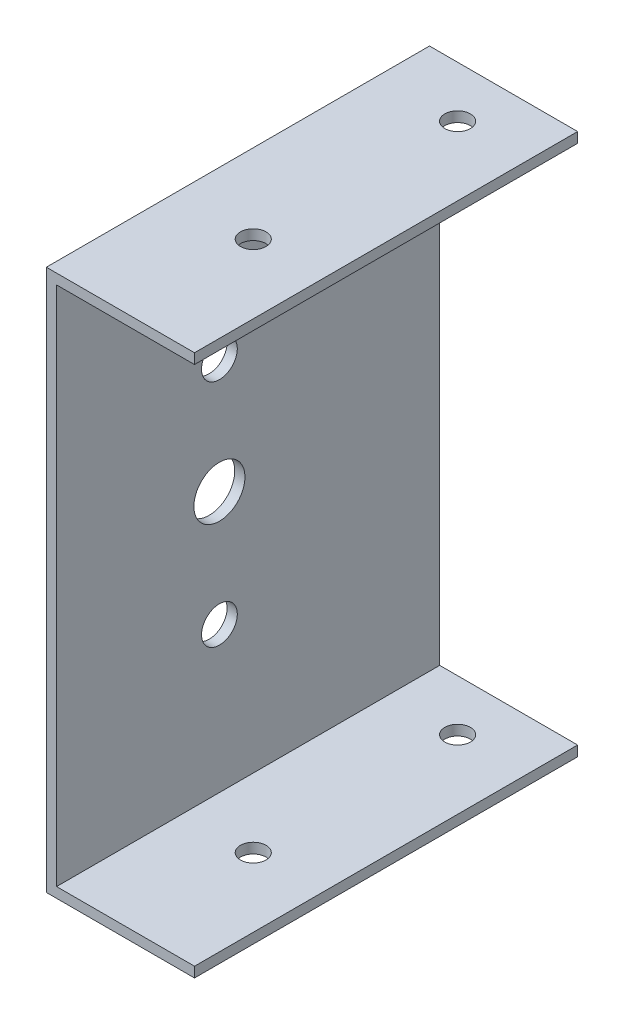
ISO-10303-21;
HEADER;
FILE_DESCRIPTION(('STEP AP214'),'2;1');
FILE_NAME('part.step','',(''),(''),'','','');
FILE_SCHEMA(('AUTOMOTIVE_DESIGN { 1 0 10303 214 1 1 1 1 }'));
ENDSEC;
DATA;
#1=APPLICATION_CONTEXT('core data for automotive mechanical design processes');
#2=APPLICATION_PROTOCOL_DEFINITION('international standard','automotive_design',2000,#1);
#3=PRODUCT_CONTEXT('',#1,'mechanical');
#4=PRODUCT('Part','Part','',(#3));
#5=PRODUCT_RELATED_PRODUCT_CATEGORY('part','',(#4));
#6=PRODUCT_DEFINITION_FORMATION('','',#4);
#7=PRODUCT_DEFINITION_CONTEXT('part definition',#1,'design');
#8=PRODUCT_DEFINITION('design','',#6,#7);
#9=PRODUCT_DEFINITION_SHAPE('','',#8);
#10=(LENGTH_UNIT() NAMED_UNIT(*) SI_UNIT(.MILLI.,.METRE.));
#11=(NAMED_UNIT(*) PLANE_ANGLE_UNIT() SI_UNIT($,.RADIAN.));
#12=(NAMED_UNIT(*) SI_UNIT($,.STERADIAN.) SOLID_ANGLE_UNIT());
#13=UNCERTAINTY_MEASURE_WITH_UNIT(LENGTH_MEASURE(1.E-05),#10,'distance_accuracy_value','');
#14=(GEOMETRIC_REPRESENTATION_CONTEXT(3) GLOBAL_UNCERTAINTY_ASSIGNED_CONTEXT((#13)) GLOBAL_UNIT_ASSIGNED_CONTEXT((#10,
#11,#12)) REPRESENTATION_CONTEXT('',''));
#15=CARTESIAN_POINT('',(0.,0.,0.));
#16=DIRECTION('',(0.,0.,1.));
#17=DIRECTION('',(1.,0.,0.));
#18=AXIS2_PLACEMENT_3D('',#15,#16,#17);
#19=CARTESIAN_POINT('',(13.5,2.,37.5));
#20=DIRECTION('',(0.,0.,-1.));
#21=DIRECTION('',(-1.,0.,0.));
#22=AXIS2_PLACEMENT_3D('',#19,#20,#21);
#23=PLANE('',#22);
#24=DIRECTION('',(1.,0.,0.));
#25=VECTOR('',#24,1.);
#26=CARTESIAN_POINT('',(13.5,0.,37.5));
#27=LINE('',#26,#25);
#28=CARTESIAN_POINT('',(-15.5,0.,37.5));
#29=VERTEX_POINT('',#28);
#30=CARTESIAN_POINT('',(13.5,0.,37.5));
#31=VERTEX_POINT('',#30);
#32=EDGE_CURVE('E70',#29,#31,#27,.T.);
#33=ORIENTED_EDGE('',*,*,#32,.T.);
#34=DIRECTION('',(0.,-1.,0.));
#35=VECTOR('',#34,1.);
#36=CARTESIAN_POINT('',(13.5,2.,37.5));
#37=LINE('',#36,#35);
#38=CARTESIAN_POINT('',(13.5,2.,37.5));
#39=VERTEX_POINT('',#38);
#40=EDGE_CURVE('E11',#39,#31,#37,.T.);
#41=ORIENTED_EDGE('',*,*,#40,.F.);
#42=DIRECTION('',(1.,0.,0.));
#43=VECTOR('',#42,1.);
#44=CARTESIAN_POINT('',(13.5,2.,37.5));
#45=LINE('',#44,#43);
#46=CARTESIAN_POINT('',(-13.5,2.,37.5));
#47=VERTEX_POINT('',#46);
#48=EDGE_CURVE('E97',#47,#39,#45,.T.);
#49=ORIENTED_EDGE('',*,*,#48,.F.);
#50=DIRECTION('',(0.,1.,0.));
#51=VECTOR('',#50,1.);
#52=CARTESIAN_POINT('',(-13.5,0.,37.5));
#53=LINE('',#52,#51);
#54=CARTESIAN_POINT('',(-13.5,104.,37.5));
#55=VERTEX_POINT('',#54);
#56=EDGE_CURVE('E87',#47,#55,#53,.T.);
#57=ORIENTED_EDGE('',*,*,#56,.T.);
#58=DIRECTION('',(1.,0.,0.));
#59=VECTOR('',#58,1.);
#60=CARTESIAN_POINT('',(-15.5,104.,37.5));
#61=LINE('',#60,#59);
#62=CARTESIAN_POINT('',(13.5,104.,37.5));
#63=VERTEX_POINT('',#62);
#64=EDGE_CURVE('E189',#55,#63,#61,.T.);
#65=ORIENTED_EDGE('',*,*,#64,.T.);
#66=DIRECTION('',(0.,-1.,0.));
#67=VECTOR('',#66,1.);
#68=CARTESIAN_POINT('',(13.5,106.,37.5));
#69=LINE('',#68,#67);
#70=CARTESIAN_POINT('',(13.5,106.,37.5));
#71=VERTEX_POINT('',#70);
#72=EDGE_CURVE('E201',#71,#63,#69,.T.);
#73=ORIENTED_EDGE('',*,*,#72,.F.);
#74=DIRECTION('',(1.,0.,0.));
#75=VECTOR('',#74,1.);
#76=CARTESIAN_POINT('',(-15.5,106.,37.5));
#77=LINE('',#76,#75);
#78=CARTESIAN_POINT('',(-15.5,106.,37.5));
#79=VERTEX_POINT('',#78);
#80=EDGE_CURVE('E197',#79,#71,#77,.T.);
#81=ORIENTED_EDGE('',*,*,#80,.F.);
#82=DIRECTION('',(0.,1.,0.));
#83=VECTOR('',#82,1.);
#84=CARTESIAN_POINT('',(-15.5,0.,37.5));
#85=LINE('',#84,#83);
#86=EDGE_CURVE('E217',#29,#79,#85,.T.);
#87=ORIENTED_EDGE('',*,*,#86,.F.);
#88=EDGE_LOOP('',(#33,#41,#49,#57,#65,#73,#81,#87));
#89=FACE_BOUND('',#88,.T.);
#90=ADVANCED_FACE('F39',(#89),#23,.F.);
#91=CARTESIAN_POINT('',(13.5,2.,37.5));
#92=DIRECTION('',(-1.,0.,0.));
#93=DIRECTION('',(0.,0.,1.));
#94=AXIS2_PLACEMENT_3D('',#91,#92,#93);
#95=PLANE('',#94);
#96=DIRECTION('',(0.,0.,-1.));
#97=VECTOR('',#96,1.);
#98=CARTESIAN_POINT('',(13.5,0.,37.5));
#99=LINE('',#98,#97);
#100=CARTESIAN_POINT('',(13.5,0.,-37.5));
#101=VERTEX_POINT('',#100);
#102=EDGE_CURVE('E108',#31,#101,#99,.T.);
#103=ORIENTED_EDGE('',*,*,#102,.T.);
#104=DIRECTION('',(0.,-1.,0.));
#105=VECTOR('',#104,1.);
#106=CARTESIAN_POINT('',(13.5,2.,-37.5));
#107=LINE('',#106,#105);
#108=CARTESIAN_POINT('',(13.5,2.,-37.5));
#109=VERTEX_POINT('',#108);
#110=EDGE_CURVE('E49',#109,#101,#107,.T.);
#111=ORIENTED_EDGE('',*,*,#110,.F.);
#112=DIRECTION('',(0.,0.,-1.));
#113=VECTOR('',#112,1.);
#114=CARTESIAN_POINT('',(13.5,2.,37.5));
#115=LINE('',#114,#113);
#116=EDGE_CURVE('E58',#39,#109,#115,.T.);
#117=ORIENTED_EDGE('',*,*,#116,.F.);
#118=ORIENTED_EDGE('',*,*,#40,.T.);
#119=EDGE_LOOP('',(#103,#111,#117,#118));
#120=FACE_BOUND('',#119,.T.);
#121=ADVANCED_FACE('F254',(#120),#95,.F.);
#122=CARTESIAN_POINT('',(13.5,2.,-37.5));
#123=DIRECTION('',(0.,0.,1.));
#124=DIRECTION('',(1.,0.,0.));
#125=AXIS2_PLACEMENT_3D('',#122,#123,#124);
#126=PLANE('',#125);
#127=DIRECTION('',(-1.,0.,0.));
#128=VECTOR('',#127,1.);
#129=CARTESIAN_POINT('',(13.5,0.,-37.5));
#130=LINE('',#129,#128);
#131=CARTESIAN_POINT('',(-15.5,0.,-37.5));
#132=VERTEX_POINT('',#131);
#133=EDGE_CURVE('E104',#101,#132,#130,.T.);
#134=ORIENTED_EDGE('',*,*,#133,.T.);
#135=DIRECTION('',(0.,-1.,0.));
#136=VECTOR('',#135,1.);
#137=CARTESIAN_POINT('',(-15.5,0.,-37.5));
#138=LINE('',#137,#136);
#139=CARTESIAN_POINT('',(-15.5,106.,-37.5));
#140=VERTEX_POINT('',#139);
#141=EDGE_CURVE('E221',#140,#132,#138,.T.);
#142=ORIENTED_EDGE('',*,*,#141,.F.);
#143=DIRECTION('',(-1.,0.,0.));
#144=VECTOR('',#143,1.);
#145=CARTESIAN_POINT('',(13.5,106.,-37.5));
#146=LINE('',#145,#144);
#147=CARTESIAN_POINT('',(13.5,106.,-37.5));
#148=VERTEX_POINT('',#147);
#149=EDGE_CURVE('E188',#148,#140,#146,.T.);
#150=ORIENTED_EDGE('',*,*,#149,.F.);
#151=DIRECTION('',(0.,-1.,0.));
#152=VECTOR('',#151,1.);
#153=CARTESIAN_POINT('',(13.5,106.,-37.5));
#154=LINE('',#153,#152);
#155=CARTESIAN_POINT('',(13.5,104.,-37.5));
#156=VERTEX_POINT('',#155);
#157=EDGE_CURVE('E95',#148,#156,#154,.T.);
#158=ORIENTED_EDGE('',*,*,#157,.T.);
#159=DIRECTION('',(-1.,0.,0.));
#160=VECTOR('',#159,1.);
#161=CARTESIAN_POINT('',(13.5,104.,-37.5));
#162=LINE('',#161,#160);
#163=CARTESIAN_POINT('',(-13.5,104.,-37.5));
#164=VERTEX_POINT('',#163);
#165=EDGE_CURVE('E205',#156,#164,#162,.T.);
#166=ORIENTED_EDGE('',*,*,#165,.T.);
#167=DIRECTION('',(0.,-1.,0.));
#168=VECTOR('',#167,1.);
#169=CARTESIAN_POINT('',(-13.5,0.,-37.5));
#170=LINE('',#169,#168);
#171=CARTESIAN_POINT('',(-13.5,2.,-37.5));
#172=VERTEX_POINT('',#171);
#173=EDGE_CURVE('E111',#164,#172,#170,.T.);
#174=ORIENTED_EDGE('',*,*,#173,.T.);
#175=DIRECTION('',(-1.,0.,0.));
#176=VECTOR('',#175,1.);
#177=CARTESIAN_POINT('',(13.5,2.,-37.5));
#178=LINE('',#177,#176);
#179=EDGE_CURVE('E102',#109,#172,#178,.T.);
#180=ORIENTED_EDGE('',*,*,#179,.F.);
#181=ORIENTED_EDGE('',*,*,#110,.T.);
#182=EDGE_LOOP('',(#134,#142,#150,#158,#166,#174,#180,#181));
#183=FACE_BOUND('',#182,.T.);
#184=ADVANCED_FACE('F233',(#183),#126,.F.);
#185=CARTESIAN_POINT('',(0.,2.,0.));
#186=DIRECTION('',(0.,1.,0.));
#187=DIRECTION('',(0.,0.,1.));
#188=AXIS2_PLACEMENT_3D('',#185,#186,#187);
#189=PLANE('',#188);
#190=CARTESIAN_POINT('',(0.,2.,-27.5));
#191=DIRECTION('',(0.,1.,0.));
#192=DIRECTION('',(0.,0.,1.));
#193=AXIS2_PLACEMENT_3D('',#190,#191,#192);
#194=CIRCLE('',#193,2.5);
#195=CARTESIAN_POINT('',(0.,2.,-25.));
#196=VERTEX_POINT('',#195);
#197=EDGE_CURVE('E171',#196,#196,#194,.T.);
#198=ORIENTED_EDGE('',*,*,#197,.F.);
#199=EDGE_LOOP('',(#198));
#200=FACE_BOUND('',#199,.T.);
#201=CARTESIAN_POINT('',(0.,2.,12.5));
#202=DIRECTION('',(0.,1.,0.));
#203=DIRECTION('',(0.,0.,1.));
#204=AXIS2_PLACEMENT_3D('',#201,#202,#203);
#205=CIRCLE('',#204,2.5);
#206=CARTESIAN_POINT('',(0.,2.,15.));
#207=VERTEX_POINT('',#206);
#208=EDGE_CURVE('E136',#207,#207,#205,.T.);
#209=ORIENTED_EDGE('',*,*,#208,.F.);
#210=EDGE_LOOP('',(#209));
#211=FACE_BOUND('',#210,.T.);
#212=DIRECTION('',(0.,0.,1.));
#213=VECTOR('',#212,1.);
#214=CARTESIAN_POINT('',(-13.5,2.,37.5));
#215=LINE('',#214,#213);
#216=EDGE_CURVE('E79',#172,#47,#215,.T.);
#217=ORIENTED_EDGE('',*,*,#216,.T.);
#218=ORIENTED_EDGE('',*,*,#48,.T.);
#219=ORIENTED_EDGE('',*,*,#116,.T.);
#220=ORIENTED_EDGE('',*,*,#179,.T.);
#221=EDGE_LOOP('',(#217,#218,#219,#220));
#222=FACE_BOUND('',#221,.T.);
#223=ADVANCED_FACE('F100',(#200,#211,#222),#189,.T.);
#224=CARTESIAN_POINT('',(0.,0.,0.));
#225=DIRECTION('',(0.,1.,0.));
#226=DIRECTION('',(0.,0.,1.));
#227=AXIS2_PLACEMENT_3D('',#224,#225,#226);
#228=PLANE('',#227);
#229=CARTESIAN_POINT('',(0.,0.,-27.5));
#230=DIRECTION('',(0.,1.,0.));
#231=DIRECTION('',(0.,0.,1.));
#232=AXIS2_PLACEMENT_3D('',#229,#230,#231);
#233=CIRCLE('',#232,2.5);
#234=CARTESIAN_POINT('',(0.,0.,-25.));
#235=VERTEX_POINT('',#234);
#236=EDGE_CURVE('E131',#235,#235,#233,.T.);
#237=ORIENTED_EDGE('',*,*,#236,.T.);
#238=EDGE_LOOP('',(#237));
#239=FACE_BOUND('',#238,.T.);
#240=CARTESIAN_POINT('',(0.,0.,12.5));
#241=DIRECTION('',(0.,1.,0.));
#242=DIRECTION('',(0.,0.,1.));
#243=AXIS2_PLACEMENT_3D('',#240,#241,#242);
#244=CIRCLE('',#243,2.5);
#245=CARTESIAN_POINT('',(0.,0.,15.));
#246=VERTEX_POINT('',#245);
#247=EDGE_CURVE('E146',#246,#246,#244,.T.);
#248=ORIENTED_EDGE('',*,*,#247,.T.);
#249=EDGE_LOOP('',(#248));
#250=FACE_BOUND('',#249,.T.);
#251=ORIENTED_EDGE('',*,*,#32,.F.);
#252=DIRECTION('',(0.,0.,1.));
#253=VECTOR('',#252,1.);
#254=CARTESIAN_POINT('',(-15.5,0.,37.5));
#255=LINE('',#254,#253);
#256=EDGE_CURVE('E120',#132,#29,#255,.T.);
#257=ORIENTED_EDGE('',*,*,#256,.F.);
#258=ORIENTED_EDGE('',*,*,#133,.F.);
#259=ORIENTED_EDGE('',*,*,#102,.F.);
#260=EDGE_LOOP('',(#251,#257,#258,#259));
#261=FACE_BOUND('',#260,.T.);
#262=ADVANCED_FACE('F252',(#239,#250,#261),#228,.F.);
#263=CARTESIAN_POINT('',(-15.5,0.,0.));
#264=DIRECTION('',(-1.,0.,0.));
#265=DIRECTION('',(0.,0.,1.));
#266=AXIS2_PLACEMENT_3D('',#263,#264,#265);
#267=PLANE('',#266);
#268=CARTESIAN_POINT('',(-15.5,75.5000000000003,5.62500000000021));
#269=DIRECTION('',(-1.,0.,0.));
#270=DIRECTION('',(0.,0.,1.));
#271=AXIS2_PLACEMENT_3D('',#268,#269,#270);
#272=CIRCLE('',#271,3.5);
#273=CARTESIAN_POINT('',(-15.5,75.5000000000003,9.12500000000022));
#274=VERTEX_POINT('',#273);
#275=EDGE_CURVE('E140',#274,#274,#272,.T.);
#276=ORIENTED_EDGE('',*,*,#275,.F.);
#277=EDGE_LOOP('',(#276));
#278=FACE_BOUND('',#277,.T.);
#279=CARTESIAN_POINT('',(-15.5,30.5000000000003,5.62500000000021));
#280=DIRECTION('',(-1.,0.,0.));
#281=DIRECTION('',(0.,0.,1.));
#282=AXIS2_PLACEMENT_3D('',#279,#280,#281);
#283=CIRCLE('',#282,3.5);
#284=CARTESIAN_POINT('',(-15.5,30.5000000000003,9.12500000000022));
#285=VERTEX_POINT('',#284);
#286=EDGE_CURVE('E148',#285,#285,#283,.T.);
#287=ORIENTED_EDGE('',*,*,#286,.F.);
#288=EDGE_LOOP('',(#287));
#289=FACE_BOUND('',#288,.T.);
#290=CARTESIAN_POINT('',(-15.5,53.0000000000003,5.62500000000021));
#291=DIRECTION('',(-1.,0.,0.));
#292=DIRECTION('',(0.,0.,1.));
#293=AXIS2_PLACEMENT_3D('',#290,#291,#292);
#294=CIRCLE('',#293,5.);
#295=CARTESIAN_POINT('',(-15.5,53.0000000000003,10.6250000000002));
#296=VERTEX_POINT('',#295);
#297=EDGE_CURVE('E175',#296,#296,#294,.T.);
#298=ORIENTED_EDGE('',*,*,#297,.F.);
#299=EDGE_LOOP('',(#298));
#300=FACE_BOUND('',#299,.T.);
#301=ORIENTED_EDGE('',*,*,#86,.T.);
#302=DIRECTION('',(0.,0.,1.));
#303=VECTOR('',#302,1.);
#304=CARTESIAN_POINT('',(-15.5,106.,-37.5));
#305=LINE('',#304,#303);
#306=EDGE_CURVE('E193',#140,#79,#305,.T.);
#307=ORIENTED_EDGE('',*,*,#306,.F.);
#308=ORIENTED_EDGE('',*,*,#141,.T.);
#309=ORIENTED_EDGE('',*,*,#256,.T.);
#310=EDGE_LOOP('',(#301,#307,#308,#309));
#311=FACE_BOUND('',#310,.T.);
#312=ADVANCED_FACE('F251',(#278,#289,#300,#311),#267,.T.);
#313=CARTESIAN_POINT('',(-13.5,0.,0.));
#314=DIRECTION('',(-1.,0.,0.));
#315=DIRECTION('',(0.,0.,1.));
#316=AXIS2_PLACEMENT_3D('',#313,#314,#315);
#317=PLANE('',#316);
#318=CARTESIAN_POINT('',(-13.5,75.5000000000003,5.62500000000021));
#319=DIRECTION('',(-1.,0.,0.));
#320=DIRECTION('',(0.,0.,1.));
#321=AXIS2_PLACEMENT_3D('',#318,#319,#320);
#322=CIRCLE('',#321,3.5);
#323=CARTESIAN_POINT('',(-13.5,75.5000000000003,9.12500000000022));
#324=VERTEX_POINT('',#323);
#325=EDGE_CURVE('E42',#324,#324,#322,.T.);
#326=ORIENTED_EDGE('',*,*,#325,.T.);
#327=EDGE_LOOP('',(#326));
#328=FACE_BOUND('',#327,.T.);
#329=CARTESIAN_POINT('',(-13.5,30.5000000000003,5.62500000000021));
#330=DIRECTION('',(-1.,0.,0.));
#331=DIRECTION('',(0.,0.,1.));
#332=AXIS2_PLACEMENT_3D('',#329,#330,#331);
#333=CIRCLE('',#332,3.5);
#334=CARTESIAN_POINT('',(-13.5,30.5000000000003,9.12500000000022));
#335=VERTEX_POINT('',#334);
#336=EDGE_CURVE('E137',#335,#335,#333,.T.);
#337=ORIENTED_EDGE('',*,*,#336,.T.);
#338=EDGE_LOOP('',(#337));
#339=FACE_BOUND('',#338,.T.);
#340=CARTESIAN_POINT('',(-13.5,53.0000000000003,5.62500000000021));
#341=DIRECTION('',(-1.,0.,0.));
#342=DIRECTION('',(0.,0.,1.));
#343=AXIS2_PLACEMENT_3D('',#340,#341,#342);
#344=CIRCLE('',#343,5.);
#345=CARTESIAN_POINT('',(-13.5,53.0000000000003,10.6250000000002));
#346=VERTEX_POINT('',#345);
#347=EDGE_CURVE('E176',#346,#346,#344,.T.);
#348=ORIENTED_EDGE('',*,*,#347,.T.);
#349=EDGE_LOOP('',(#348));
#350=FACE_BOUND('',#349,.T.);
#351=ORIENTED_EDGE('',*,*,#216,.F.);
#352=ORIENTED_EDGE('',*,*,#173,.F.);
#353=DIRECTION('',(0.,0.,-1.));
#354=VECTOR('',#353,1.);
#355=CARTESIAN_POINT('',(-13.5,104.,37.5));
#356=LINE('',#355,#354);
#357=EDGE_CURVE('E91',#55,#164,#356,.T.);
#358=ORIENTED_EDGE('',*,*,#357,.F.);
#359=ORIENTED_EDGE('',*,*,#56,.F.);
#360=EDGE_LOOP('',(#351,#352,#358,#359));
#361=FACE_BOUND('',#360,.T.);
#362=ADVANCED_FACE('F89',(#328,#339,#350,#361),#317,.F.);
#363=CARTESIAN_POINT('',(0.,104.,0.));
#364=DIRECTION('',(0.,1.,0.));
#365=DIRECTION('',(0.,0.,1.));
#366=AXIS2_PLACEMENT_3D('',#363,#364,#365);
#367=PLANE('',#366);
#368=CARTESIAN_POINT('',(0.,104.,-27.5));
#369=DIRECTION('',(0.,1.,0.));
#370=DIRECTION('',(0.,0.,1.));
#371=AXIS2_PLACEMENT_3D('',#368,#369,#370);
#372=CIRCLE('',#371,2.5);
#373=CARTESIAN_POINT('',(0.,104.,-25.));
#374=VERTEX_POINT('',#373);
#375=EDGE_CURVE('E135',#374,#374,#372,.T.);
#376=ORIENTED_EDGE('',*,*,#375,.T.);
#377=EDGE_LOOP('',(#376));
#378=FACE_BOUND('',#377,.T.);
#379=CARTESIAN_POINT('',(0.,104.,12.5));
#380=DIRECTION('',(0.,1.,0.));
#381=DIRECTION('',(0.,0.,1.));
#382=AXIS2_PLACEMENT_3D('',#379,#380,#381);
#383=CIRCLE('',#382,2.5);
#384=CARTESIAN_POINT('',(0.,104.,15.));
#385=VERTEX_POINT('',#384);
#386=EDGE_CURVE('E130',#385,#385,#383,.T.);
#387=ORIENTED_EDGE('',*,*,#386,.T.);
#388=EDGE_LOOP('',(#387));
#389=FACE_BOUND('',#388,.T.);
#390=ORIENTED_EDGE('',*,*,#64,.F.);
#391=ORIENTED_EDGE('',*,*,#357,.T.);
#392=ORIENTED_EDGE('',*,*,#165,.F.);
#393=DIRECTION('',(0.,0.,-1.));
#394=VECTOR('',#393,1.);
#395=CARTESIAN_POINT('',(13.5,104.,37.5));
#396=LINE('',#395,#394);
#397=EDGE_CURVE('E180',#63,#156,#396,.T.);
#398=ORIENTED_EDGE('',*,*,#397,.F.);
#399=EDGE_LOOP('',(#390,#391,#392,#398));
#400=FACE_BOUND('',#399,.T.);
#401=ADVANCED_FACE('F270',(#378,#389,#400),#367,.F.);
#402=CARTESIAN_POINT('',(13.5,106.,37.5));
#403=DIRECTION('',(-1.,0.,0.));
#404=DIRECTION('',(0.,0.,1.));
#405=AXIS2_PLACEMENT_3D('',#402,#403,#404);
#406=PLANE('',#405);
#407=ORIENTED_EDGE('',*,*,#397,.T.);
#408=ORIENTED_EDGE('',*,*,#157,.F.);
#409=DIRECTION('',(0.,0.,-1.));
#410=VECTOR('',#409,1.);
#411=CARTESIAN_POINT('',(13.5,106.,37.5));
#412=LINE('',#411,#410);
#413=EDGE_CURVE('E184',#71,#148,#412,.T.);
#414=ORIENTED_EDGE('',*,*,#413,.F.);
#415=ORIENTED_EDGE('',*,*,#72,.T.);
#416=EDGE_LOOP('',(#407,#408,#414,#415));
#417=FACE_BOUND('',#416,.T.);
#418=ADVANCED_FACE('F275',(#417),#406,.F.);
#419=CARTESIAN_POINT('',(0.,106.,0.));
#420=DIRECTION('',(0.,1.,0.));
#421=DIRECTION('',(0.,0.,1.));
#422=AXIS2_PLACEMENT_3D('',#419,#420,#421);
#423=PLANE('',#422);
#424=CARTESIAN_POINT('',(0.,106.,-27.5));
#425=DIRECTION('',(0.,1.,0.));
#426=DIRECTION('',(0.,0.,1.));
#427=AXIS2_PLACEMENT_3D('',#424,#425,#426);
#428=CIRCLE('',#427,2.5);
#429=CARTESIAN_POINT('',(0.,106.,-25.));
#430=VERTEX_POINT('',#429);
#431=EDGE_CURVE('E132',#430,#430,#428,.T.);
#432=ORIENTED_EDGE('',*,*,#431,.F.);
#433=EDGE_LOOP('',(#432));
#434=FACE_BOUND('',#433,.T.);
#435=CARTESIAN_POINT('',(0.,106.,12.5));
#436=DIRECTION('',(0.,1.,0.));
#437=DIRECTION('',(0.,0.,1.));
#438=AXIS2_PLACEMENT_3D('',#435,#436,#437);
#439=CIRCLE('',#438,2.5);
#440=CARTESIAN_POINT('',(0.,106.,15.));
#441=VERTEX_POINT('',#440);
#442=EDGE_CURVE('E126',#441,#441,#439,.T.);
#443=ORIENTED_EDGE('',*,*,#442,.F.);
#444=EDGE_LOOP('',(#443));
#445=FACE_BOUND('',#444,.T.);
#446=ORIENTED_EDGE('',*,*,#413,.T.);
#447=ORIENTED_EDGE('',*,*,#149,.T.);
#448=ORIENTED_EDGE('',*,*,#306,.T.);
#449=ORIENTED_EDGE('',*,*,#80,.T.);
#450=EDGE_LOOP('',(#446,#447,#448,#449));
#451=FACE_BOUND('',#450,.T.);
#452=ADVANCED_FACE('F278',(#434,#445,#451),#423,.T.);
#453=CARTESIAN_POINT('',(-13.5,53.0000000000003,5.62500000000021));
#454=DIRECTION('',(-1.,0.,0.));
#455=DIRECTION('',(0.,0.,1.));
#456=AXIS2_PLACEMENT_3D('',#453,#454,#455);
#457=CYLINDRICAL_SURFACE('',#456,5.);
#458=ORIENTED_EDGE('',*,*,#347,.F.);
#459=EDGE_LOOP('',(#458));
#460=FACE_BOUND('',#459,.T.);
#461=ORIENTED_EDGE('',*,*,#297,.T.);
#462=EDGE_LOOP('',(#461));
#463=FACE_BOUND('',#462,.T.);
#464=ADVANCED_FACE('F285',(#460,#463),#457,.F.);
#465=CARTESIAN_POINT('',(0.,0.,12.5));
#466=DIRECTION('',(0.,1.,0.));
#467=DIRECTION('',(0.,0.,1.));
#468=AXIS2_PLACEMENT_3D('',#465,#466,#467);
#469=CYLINDRICAL_SURFACE('',#468,2.5);
#470=ORIENTED_EDGE('',*,*,#442,.T.);
#471=EDGE_LOOP('',(#470));
#472=FACE_BOUND('',#471,.T.);
#473=ORIENTED_EDGE('',*,*,#386,.F.);
#474=EDGE_LOOP('',(#473));
#475=FACE_BOUND('',#474,.T.);
#476=ADVANCED_FACE('F289',(#472,#475),#469,.F.);
#477=CARTESIAN_POINT('',(0.,0.,-27.5));
#478=DIRECTION('',(0.,1.,0.));
#479=DIRECTION('',(0.,0.,1.));
#480=AXIS2_PLACEMENT_3D('',#477,#478,#479);
#481=CYLINDRICAL_SURFACE('',#480,2.5);
#482=ORIENTED_EDGE('',*,*,#431,.T.);
#483=EDGE_LOOP('',(#482));
#484=FACE_BOUND('',#483,.T.);
#485=ORIENTED_EDGE('',*,*,#375,.F.);
#486=EDGE_LOOP('',(#485));
#487=FACE_BOUND('',#486,.T.);
#488=ADVANCED_FACE('F295',(#484,#487),#481,.F.);
#489=ORIENTED_EDGE('',*,*,#208,.T.);
#490=EDGE_LOOP('',(#489));
#491=FACE_BOUND('',#490,.T.);
#492=ORIENTED_EDGE('',*,*,#247,.F.);
#493=EDGE_LOOP('',(#492));
#494=FACE_BOUND('',#493,.T.);
#495=ADVANCED_FACE('F291',(#491,#494),#469,.F.);
#496=ORIENTED_EDGE('',*,*,#197,.T.);
#497=EDGE_LOOP('',(#496));
#498=FACE_BOUND('',#497,.T.);
#499=ORIENTED_EDGE('',*,*,#236,.F.);
#500=EDGE_LOOP('',(#499));
#501=FACE_BOUND('',#500,.T.);
#502=ADVANCED_FACE('F294',(#498,#501),#481,.F.);
#503=CARTESIAN_POINT('',(-5.5,30.5000000000003,5.62500000000021));
#504=DIRECTION('',(-1.,0.,0.));
#505=DIRECTION('',(0.,0.,1.));
#506=AXIS2_PLACEMENT_3D('',#503,#504,#505);
#507=CYLINDRICAL_SURFACE('',#506,3.5);
#508=ORIENTED_EDGE('',*,*,#286,.T.);
#509=EDGE_LOOP('',(#508));
#510=FACE_BOUND('',#509,.T.);
#511=ORIENTED_EDGE('',*,*,#336,.F.);
#512=EDGE_LOOP('',(#511));
#513=FACE_BOUND('',#512,.T.);
#514=ADVANCED_FACE('F299',(#510,#513),#507,.F.);
#515=CARTESIAN_POINT('',(-5.5,75.5000000000003,5.62500000000021));
#516=DIRECTION('',(-1.,0.,0.));
#517=DIRECTION('',(0.,0.,1.));
#518=AXIS2_PLACEMENT_3D('',#515,#516,#517);
#519=CYLINDRICAL_SURFACE('',#518,3.5);
#520=ORIENTED_EDGE('',*,*,#275,.T.);
#521=EDGE_LOOP('',(#520));
#522=FACE_BOUND('',#521,.T.);
#523=ORIENTED_EDGE('',*,*,#325,.F.);
#524=EDGE_LOOP('',(#523));
#525=FACE_BOUND('',#524,.T.);
#526=ADVANCED_FACE('F303',(#522,#525),#519,.F.);
#527=CLOSED_SHELL('',(#90,#121,#184,#223,#262,#312,#362,#401,#418,#452,#464,#476,#488,#495,#502,
#514,#526));
#528=MANIFOLD_SOLID_BREP('B2',#527);
#529=ADVANCED_BREP_SHAPE_REPRESENTATION('',(#18,#528),#14);
#530=SHAPE_DEFINITION_REPRESENTATION(#9,#529);
ENDSEC;
END-ISO-10303-21;
